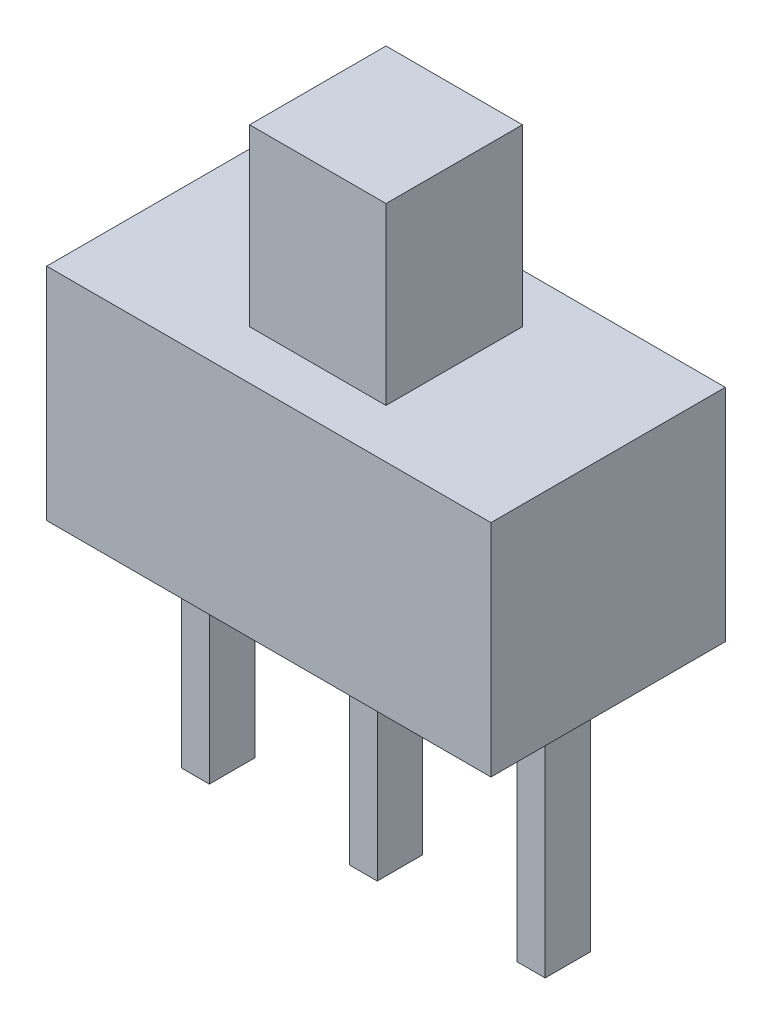
ISO-10303-21;
HEADER;
FILE_DESCRIPTION(('STEP AP214'),'2;1');
FILE_NAME('part.step','',(''),(''),'','','');
FILE_SCHEMA(('AUTOMOTIVE_DESIGN { 1 0 10303 214 1 1 1 1 }'));
ENDSEC;
DATA;
#1=APPLICATION_CONTEXT('core data for automotive mechanical design processes');
#2=APPLICATION_PROTOCOL_DEFINITION('international standard','automotive_design',2000,#1);
#3=PRODUCT_CONTEXT('',#1,'mechanical');
#4=PRODUCT('Part','Part','',(#3));
#5=PRODUCT_RELATED_PRODUCT_CATEGORY('part','',(#4));
#6=PRODUCT_DEFINITION_FORMATION('','',#4);
#7=PRODUCT_DEFINITION_CONTEXT('part definition',#1,'design');
#8=PRODUCT_DEFINITION('design','',#6,#7);
#9=PRODUCT_DEFINITION_SHAPE('','',#8);
#10=(LENGTH_UNIT() NAMED_UNIT(*) SI_UNIT(.MILLI.,.METRE.));
#11=(NAMED_UNIT(*) PLANE_ANGLE_UNIT() SI_UNIT($,.RADIAN.));
#12=(NAMED_UNIT(*) SI_UNIT($,.STERADIAN.) SOLID_ANGLE_UNIT());
#13=UNCERTAINTY_MEASURE_WITH_UNIT(LENGTH_MEASURE(1.E-05),#10,'distance_accuracy_value','');
#14=(GEOMETRIC_REPRESENTATION_CONTEXT(3) GLOBAL_UNCERTAINTY_ASSIGNED_CONTEXT((#13)) GLOBAL_UNIT_ASSIGNED_CONTEXT((#10,
#11,#12)) REPRESENTATION_CONTEXT('',''));
#15=CARTESIAN_POINT('',(0.,0.,0.));
#16=DIRECTION('',(0.,0.,1.));
#17=DIRECTION('',(1.,0.,0.));
#18=AXIS2_PLACEMENT_3D('',#15,#16,#17);
#19=CARTESIAN_POINT('',(0.,0.,0.));
#20=DIRECTION('',(0.,1.,0.));
#21=DIRECTION('',(0.,0.,1.));
#22=AXIS2_PLACEMENT_3D('',#19,#20,#21);
#23=PLANE('',#22);
#24=DIRECTION('',(0.,0.,1.));
#25=VECTOR('',#24,1.);
#26=CARTESIAN_POINT('',(-4.4,0.,-0.65));
#27=LINE('',#26,#25);
#28=CARTESIAN_POINT('',(-4.4,0.,-0.65));
#29=VERTEX_POINT('',#28);
#30=CARTESIAN_POINT('',(-4.4,0.,0.65));
#31=VERTEX_POINT('',#30);
#32=EDGE_CURVE('E195',#29,#31,#27,.T.);
#33=ORIENTED_EDGE('',*,*,#32,.F.);
#34=DIRECTION('',(1.,0.,0.));
#35=VECTOR('',#34,1.);
#36=CARTESIAN_POINT('',(-5.2,0.,-0.65));
#37=LINE('',#36,#35);
#38=CARTESIAN_POINT('',(-5.2,0.,-0.65));
#39=VERTEX_POINT('',#38);
#40=EDGE_CURVE('E208',#39,#29,#37,.T.);
#41=ORIENTED_EDGE('',*,*,#40,.F.);
#42=DIRECTION('',(0.,0.,-1.));
#43=VECTOR('',#42,1.);
#44=CARTESIAN_POINT('',(-5.2,0.,-0.65));
#45=LINE('',#44,#43);
#46=CARTESIAN_POINT('',(-5.2,0.,0.65));
#47=VERTEX_POINT('',#46);
#48=EDGE_CURVE('E217',#47,#39,#45,.T.);
#49=ORIENTED_EDGE('',*,*,#48,.F.);
#50=DIRECTION('',(-1.,0.,0.));
#51=VECTOR('',#50,1.);
#52=CARTESIAN_POINT('',(-5.2,0.,0.65));
#53=LINE('',#52,#51);
#54=EDGE_CURVE('E198',#31,#47,#53,.T.);
#55=ORIENTED_EDGE('',*,*,#54,.F.);
#56=EDGE_LOOP('',(#33,#41,#49,#55));
#57=FACE_BOUND('',#56,.T.);
#58=DIRECTION('',(0.,0.,-1.));
#59=VECTOR('',#58,1.);
#60=CARTESIAN_POINT('',(6.35,0.,-3.35));
#61=LINE('',#60,#59);
#62=CARTESIAN_POINT('',(6.35,0.,3.35));
#63=VERTEX_POINT('',#62);
#64=CARTESIAN_POINT('',(6.35,0.,-3.35));
#65=VERTEX_POINT('',#64);
#66=EDGE_CURVE('E299',#63,#65,#61,.T.);
#67=ORIENTED_EDGE('',*,*,#66,.F.);
#68=DIRECTION('',(1.,0.,0.));
#69=VECTOR('',#68,1.);
#70=CARTESIAN_POINT('',(-6.35,0.,3.35));
#71=LINE('',#70,#69);
#72=CARTESIAN_POINT('',(-6.35,0.,3.35));
#73=VERTEX_POINT('',#72);
#74=EDGE_CURVE('E304',#73,#63,#71,.T.);
#75=ORIENTED_EDGE('',*,*,#74,.F.);
#76=DIRECTION('',(0.,0.,1.));
#77=VECTOR('',#76,1.);
#78=CARTESIAN_POINT('',(-6.35,0.,-3.35));
#79=LINE('',#78,#77);
#80=CARTESIAN_POINT('',(-6.35,0.,-3.35));
#81=VERTEX_POINT('',#80);
#82=EDGE_CURVE('E315',#81,#73,#79,.T.);
#83=ORIENTED_EDGE('',*,*,#82,.F.);
#84=DIRECTION('',(-1.,0.,0.));
#85=VECTOR('',#84,1.);
#86=CARTESIAN_POINT('',(-6.35,0.,-3.35));
#87=LINE('',#86,#85);
#88=EDGE_CURVE('E313',#65,#81,#87,.T.);
#89=ORIENTED_EDGE('',*,*,#88,.F.);
#90=EDGE_LOOP('',(#67,#75,#83,#89));
#91=FACE_BOUND('',#90,.T.);
#92=DIRECTION('',(0.,0.,1.));
#93=VECTOR('',#92,1.);
#94=CARTESIAN_POINT('',(0.4,0.,-0.65));
#95=LINE('',#94,#93);
#96=CARTESIAN_POINT('',(0.4,0.,-0.65));
#97=VERTEX_POINT('',#96);
#98=CARTESIAN_POINT('',(0.4,0.,0.65));
#99=VERTEX_POINT('',#98);
#100=EDGE_CURVE('E233',#97,#99,#95,.T.);
#101=ORIENTED_EDGE('',*,*,#100,.F.);
#102=DIRECTION('',(1.,0.,0.));
#103=VECTOR('',#102,1.);
#104=CARTESIAN_POINT('',(-0.4,0.,-0.65));
#105=LINE('',#104,#103);
#106=CARTESIAN_POINT('',(-0.4,0.,-0.65));
#107=VERTEX_POINT('',#106);
#108=EDGE_CURVE('E238',#107,#97,#105,.T.);
#109=ORIENTED_EDGE('',*,*,#108,.F.);
#110=DIRECTION('',(0.,0.,-1.));
#111=VECTOR('',#110,1.);
#112=CARTESIAN_POINT('',(-0.4,0.,-0.65));
#113=LINE('',#112,#111);
#114=CARTESIAN_POINT('',(-0.4,0.,0.65));
#115=VERTEX_POINT('',#114);
#116=EDGE_CURVE('E250',#115,#107,#113,.T.);
#117=ORIENTED_EDGE('',*,*,#116,.F.);
#118=DIRECTION('',(-1.,0.,0.));
#119=VECTOR('',#118,1.);
#120=CARTESIAN_POINT('',(-0.4,0.,0.65));
#121=LINE('',#120,#119);
#122=EDGE_CURVE('E247',#99,#115,#121,.T.);
#123=ORIENTED_EDGE('',*,*,#122,.F.);
#124=EDGE_LOOP('',(#101,#109,#117,#123));
#125=FACE_BOUND('',#124,.T.);
#126=DIRECTION('',(0.,0.,1.));
#127=VECTOR('',#126,1.);
#128=CARTESIAN_POINT('',(5.2,0.,-0.65));
#129=LINE('',#128,#127);
#130=CARTESIAN_POINT('',(5.2,0.,-0.65));
#131=VERTEX_POINT('',#130);
#132=CARTESIAN_POINT('',(5.2,0.,0.65));
#133=VERTEX_POINT('',#132);
#134=EDGE_CURVE('E194',#131,#133,#129,.T.);
#135=ORIENTED_EDGE('',*,*,#134,.F.);
#136=DIRECTION('',(1.,0.,0.));
#137=VECTOR('',#136,1.);
#138=CARTESIAN_POINT('',(4.4,0.,-0.65));
#139=LINE('',#138,#137);
#140=CARTESIAN_POINT('',(4.4,0.,-0.65));
#141=VERTEX_POINT('',#140);
#142=EDGE_CURVE('E191',#141,#131,#139,.T.);
#143=ORIENTED_EDGE('',*,*,#142,.F.);
#144=DIRECTION('',(0.,0.,-1.));
#145=VECTOR('',#144,1.);
#146=CARTESIAN_POINT('',(4.4,0.,-0.65));
#147=LINE('',#146,#145);
#148=CARTESIAN_POINT('',(4.4,0.,0.65));
#149=VERTEX_POINT('',#148);
#150=EDGE_CURVE('E57',#149,#141,#147,.T.);
#151=ORIENTED_EDGE('',*,*,#150,.F.);
#152=DIRECTION('',(-1.,0.,0.));
#153=VECTOR('',#152,1.);
#154=CARTESIAN_POINT('',(4.4,0.,0.65));
#155=LINE('',#154,#153);
#156=EDGE_CURVE('E52',#133,#149,#155,.T.);
#157=ORIENTED_EDGE('',*,*,#156,.F.);
#158=EDGE_LOOP('',(#135,#143,#151,#157));
#159=FACE_BOUND('',#158,.T.);
#160=ADVANCED_FACE('F37',(#57,#91,#125,#159),#23,.F.);
#161=CARTESIAN_POINT('',(6.35,6.3,-3.35));
#162=DIRECTION('',(-1.,0.,0.));
#163=DIRECTION('',(0.,0.,1.));
#164=AXIS2_PLACEMENT_3D('',#161,#162,#163);
#165=PLANE('',#164);
#166=ORIENTED_EDGE('',*,*,#66,.T.);
#167=DIRECTION('',(0.,-1.,0.));
#168=VECTOR('',#167,1.);
#169=CARTESIAN_POINT('',(6.35,6.3,-3.35));
#170=LINE('',#169,#168);
#171=CARTESIAN_POINT('',(6.35,6.3,-3.35));
#172=VERTEX_POINT('',#171);
#173=EDGE_CURVE('E11',#172,#65,#170,.T.);
#174=ORIENTED_EDGE('',*,*,#173,.F.);
#175=DIRECTION('',(0.,0.,-1.));
#176=VECTOR('',#175,1.);
#177=CARTESIAN_POINT('',(6.35,6.3,-3.35));
#178=LINE('',#177,#176);
#179=CARTESIAN_POINT('',(6.35,6.3,3.35));
#180=VERTEX_POINT('',#179);
#181=EDGE_CURVE('E300',#180,#172,#178,.T.);
#182=ORIENTED_EDGE('',*,*,#181,.F.);
#183=DIRECTION('',(0.,-1.,0.));
#184=VECTOR('',#183,1.);
#185=CARTESIAN_POINT('',(6.35,6.3,3.35));
#186=LINE('',#185,#184);
#187=EDGE_CURVE('E310',#180,#63,#186,.T.);
#188=ORIENTED_EDGE('',*,*,#187,.T.);
#189=EDGE_LOOP('',(#166,#174,#182,#188));
#190=FACE_BOUND('',#189,.T.);
#191=ADVANCED_FACE('F39',(#190),#165,.F.);
#192=CARTESIAN_POINT('',(-6.35,6.3,-3.35));
#193=DIRECTION('',(0.,0.,1.));
#194=DIRECTION('',(1.,0.,0.));
#195=AXIS2_PLACEMENT_3D('',#192,#193,#194);
#196=PLANE('',#195);
#197=ORIENTED_EDGE('',*,*,#88,.T.);
#198=DIRECTION('',(0.,-1.,0.));
#199=VECTOR('',#198,1.);
#200=CARTESIAN_POINT('',(-6.35,6.3,-3.35));
#201=LINE('',#200,#199);
#202=CARTESIAN_POINT('',(-6.35,6.3,-3.35));
#203=VERTEX_POINT('',#202);
#204=EDGE_CURVE('E45',#203,#81,#201,.T.);
#205=ORIENTED_EDGE('',*,*,#204,.F.);
#206=DIRECTION('',(-1.,0.,0.));
#207=VECTOR('',#206,1.);
#208=CARTESIAN_POINT('',(-6.35,6.3,-3.35));
#209=LINE('',#208,#207);
#210=EDGE_CURVE('E303',#172,#203,#209,.T.);
#211=ORIENTED_EDGE('',*,*,#210,.F.);
#212=ORIENTED_EDGE('',*,*,#173,.T.);
#213=EDGE_LOOP('',(#197,#205,#211,#212));
#214=FACE_BOUND('',#213,.T.);
#215=ADVANCED_FACE('F343',(#214),#196,.F.);
#216=CARTESIAN_POINT('',(-6.35,6.3,-3.35));
#217=DIRECTION('',(1.,0.,0.));
#218=DIRECTION('',(0.,0.,-1.));
#219=AXIS2_PLACEMENT_3D('',#216,#217,#218);
#220=PLANE('',#219);
#221=ORIENTED_EDGE('',*,*,#82,.T.);
#222=DIRECTION('',(0.,-1.,0.));
#223=VECTOR('',#222,1.);
#224=CARTESIAN_POINT('',(-6.35,6.3,3.35));
#225=LINE('',#224,#223);
#226=CARTESIAN_POINT('',(-6.35,6.3,3.35));
#227=VERTEX_POINT('',#226);
#228=EDGE_CURVE('E320',#227,#73,#225,.T.);
#229=ORIENTED_EDGE('',*,*,#228,.F.);
#230=DIRECTION('',(0.,0.,1.));
#231=VECTOR('',#230,1.);
#232=CARTESIAN_POINT('',(-6.35,6.3,-3.35));
#233=LINE('',#232,#231);
#234=EDGE_CURVE('E306',#203,#227,#233,.T.);
#235=ORIENTED_EDGE('',*,*,#234,.F.);
#236=ORIENTED_EDGE('',*,*,#204,.T.);
#237=EDGE_LOOP('',(#221,#229,#235,#236));
#238=FACE_BOUND('',#237,.T.);
#239=ADVANCED_FACE('F327',(#238),#220,.F.);
#240=CARTESIAN_POINT('',(-6.35,6.3,3.35));
#241=DIRECTION('',(0.,0.,-1.));
#242=DIRECTION('',(-1.,0.,0.));
#243=AXIS2_PLACEMENT_3D('',#240,#241,#242);
#244=PLANE('',#243);
#245=ORIENTED_EDGE('',*,*,#74,.T.);
#246=ORIENTED_EDGE('',*,*,#187,.F.);
#247=DIRECTION('',(1.,0.,0.));
#248=VECTOR('',#247,1.);
#249=CARTESIAN_POINT('',(-6.35,6.3,3.35));
#250=LINE('',#249,#248);
#251=EDGE_CURVE('E308',#227,#180,#250,.T.);
#252=ORIENTED_EDGE('',*,*,#251,.F.);
#253=ORIENTED_EDGE('',*,*,#228,.T.);
#254=EDGE_LOOP('',(#245,#246,#252,#253));
#255=FACE_BOUND('',#254,.T.);
#256=ADVANCED_FACE('F336',(#255),#244,.F.);
#257=CARTESIAN_POINT('',(0.,6.3,0.));
#258=DIRECTION('',(0.,1.,0.));
#259=DIRECTION('',(0.,0.,1.));
#260=AXIS2_PLACEMENT_3D('',#257,#258,#259);
#261=PLANE('',#260);
#262=DIRECTION('',(0.,0.,-1.));
#263=VECTOR('',#262,1.);
#264=CARTESIAN_POINT('',(1.95,6.3,1.95));
#265=LINE('',#264,#263);
#266=CARTESIAN_POINT('',(1.95,6.3,1.95));
#267=VERTEX_POINT('',#266);
#268=CARTESIAN_POINT('',(1.95,6.3,-1.95));
#269=VERTEX_POINT('',#268);
#270=EDGE_CURVE('E266',#267,#269,#265,.T.);
#271=ORIENTED_EDGE('',*,*,#270,.F.);
#272=DIRECTION('',(1.,0.,0.));
#273=VECTOR('',#272,1.);
#274=CARTESIAN_POINT('',(-1.95,6.3,1.95));
#275=LINE('',#274,#273);
#276=CARTESIAN_POINT('',(-1.95,6.3,1.95));
#277=VERTEX_POINT('',#276);
#278=EDGE_CURVE('E271',#277,#267,#275,.T.);
#279=ORIENTED_EDGE('',*,*,#278,.F.);
#280=DIRECTION('',(0.,0.,1.));
#281=VECTOR('',#280,1.);
#282=CARTESIAN_POINT('',(-1.95,6.3,1.95));
#283=LINE('',#282,#281);
#284=CARTESIAN_POINT('',(-1.95,6.3,-1.95));
#285=VERTEX_POINT('',#284);
#286=EDGE_CURVE('E283',#285,#277,#283,.T.);
#287=ORIENTED_EDGE('',*,*,#286,.F.);
#288=DIRECTION('',(-1.,0.,0.));
#289=VECTOR('',#288,1.);
#290=CARTESIAN_POINT('',(-1.95,6.3,-1.95));
#291=LINE('',#290,#289);
#292=EDGE_CURVE('E280',#269,#285,#291,.T.);
#293=ORIENTED_EDGE('',*,*,#292,.F.);
#294=EDGE_LOOP('',(#271,#279,#287,#293));
#295=FACE_BOUND('',#294,.T.);
#296=ORIENTED_EDGE('',*,*,#181,.T.);
#297=ORIENTED_EDGE('',*,*,#210,.T.);
#298=ORIENTED_EDGE('',*,*,#234,.T.);
#299=ORIENTED_EDGE('',*,*,#251,.T.);
#300=EDGE_LOOP('',(#296,#297,#298,#299));
#301=FACE_BOUND('',#300,.T.);
#302=ADVANCED_FACE('F342',(#295,#301),#261,.T.);
#303=CARTESIAN_POINT('',(1.95,11.3,1.95));
#304=DIRECTION('',(-1.,0.,0.));
#305=DIRECTION('',(0.,0.,1.));
#306=AXIS2_PLACEMENT_3D('',#303,#304,#305);
#307=PLANE('',#306);
#308=ORIENTED_EDGE('',*,*,#270,.T.);
#309=DIRECTION('',(0.,-1.,0.));
#310=VECTOR('',#309,1.);
#311=CARTESIAN_POINT('',(1.95,11.3,-1.95));
#312=LINE('',#311,#310);
#313=CARTESIAN_POINT('',(1.95,11.3,-1.95));
#314=VERTEX_POINT('',#313);
#315=EDGE_CURVE('E296',#314,#269,#312,.T.);
#316=ORIENTED_EDGE('',*,*,#315,.F.);
#317=DIRECTION('',(0.,0.,-1.));
#318=VECTOR('',#317,1.);
#319=CARTESIAN_POINT('',(1.95,11.3,1.95));
#320=LINE('',#319,#318);
#321=CARTESIAN_POINT('',(1.95,11.3,1.95));
#322=VERTEX_POINT('',#321);
#323=EDGE_CURVE('E267',#322,#314,#320,.T.);
#324=ORIENTED_EDGE('',*,*,#323,.F.);
#325=DIRECTION('',(0.,-1.,0.));
#326=VECTOR('',#325,1.);
#327=CARTESIAN_POINT('',(1.95,11.3,1.95));
#328=LINE('',#327,#326);
#329=EDGE_CURVE('E277',#322,#267,#328,.T.);
#330=ORIENTED_EDGE('',*,*,#329,.T.);
#331=EDGE_LOOP('',(#308,#316,#324,#330));
#332=FACE_BOUND('',#331,.T.);
#333=ADVANCED_FACE('F362',(#332),#307,.F.);
#334=CARTESIAN_POINT('',(-1.95,11.3,-1.95));
#335=DIRECTION('',(0.,0.,1.));
#336=DIRECTION('',(1.,0.,0.));
#337=AXIS2_PLACEMENT_3D('',#334,#335,#336);
#338=PLANE('',#337);
#339=ORIENTED_EDGE('',*,*,#292,.T.);
#340=DIRECTION('',(0.,-1.,0.));
#341=VECTOR('',#340,1.);
#342=CARTESIAN_POINT('',(-1.95,11.3,-1.95));
#343=LINE('',#342,#341);
#344=CARTESIAN_POINT('',(-1.95,11.3,-1.95));
#345=VERTEX_POINT('',#344);
#346=EDGE_CURVE('E293',#345,#285,#343,.T.);
#347=ORIENTED_EDGE('',*,*,#346,.F.);
#348=DIRECTION('',(-1.,0.,0.));
#349=VECTOR('',#348,1.);
#350=CARTESIAN_POINT('',(-1.95,11.3,-1.95));
#351=LINE('',#350,#349);
#352=EDGE_CURVE('E270',#314,#345,#351,.T.);
#353=ORIENTED_EDGE('',*,*,#352,.F.);
#354=ORIENTED_EDGE('',*,*,#315,.T.);
#355=EDGE_LOOP('',(#339,#347,#353,#354));
#356=FACE_BOUND('',#355,.T.);
#357=ADVANCED_FACE('F367',(#356),#338,.F.);
#358=CARTESIAN_POINT('',(-1.95,11.3,1.95));
#359=DIRECTION('',(1.,0.,0.));
#360=DIRECTION('',(0.,0.,-1.));
#361=AXIS2_PLACEMENT_3D('',#358,#359,#360);
#362=PLANE('',#361);
#363=ORIENTED_EDGE('',*,*,#286,.T.);
#364=DIRECTION('',(0.,-1.,0.));
#365=VECTOR('',#364,1.);
#366=CARTESIAN_POINT('',(-1.95,11.3,1.95));
#367=LINE('',#366,#365);
#368=CARTESIAN_POINT('',(-1.95,11.3,1.95));
#369=VERTEX_POINT('',#368);
#370=EDGE_CURVE('E290',#369,#277,#367,.T.);
#371=ORIENTED_EDGE('',*,*,#370,.F.);
#372=DIRECTION('',(0.,0.,1.));
#373=VECTOR('',#372,1.);
#374=CARTESIAN_POINT('',(-1.95,11.3,1.95));
#375=LINE('',#374,#373);
#376=EDGE_CURVE('E273',#345,#369,#375,.T.);
#377=ORIENTED_EDGE('',*,*,#376,.F.);
#378=ORIENTED_EDGE('',*,*,#346,.T.);
#379=EDGE_LOOP('',(#363,#371,#377,#378));
#380=FACE_BOUND('',#379,.T.);
#381=ADVANCED_FACE('F381',(#380),#362,.F.);
#382=CARTESIAN_POINT('',(-1.95,11.3,1.95));
#383=DIRECTION('',(0.,0.,-1.));
#384=DIRECTION('',(-1.,0.,0.));
#385=AXIS2_PLACEMENT_3D('',#382,#383,#384);
#386=PLANE('',#385);
#387=ORIENTED_EDGE('',*,*,#278,.T.);
#388=ORIENTED_EDGE('',*,*,#329,.F.);
#389=DIRECTION('',(1.,0.,0.));
#390=VECTOR('',#389,1.);
#391=CARTESIAN_POINT('',(-1.95,11.3,1.95));
#392=LINE('',#391,#390);
#393=EDGE_CURVE('E275',#369,#322,#392,.T.);
#394=ORIENTED_EDGE('',*,*,#393,.F.);
#395=ORIENTED_EDGE('',*,*,#370,.T.);
#396=EDGE_LOOP('',(#387,#388,#394,#395));
#397=FACE_BOUND('',#396,.T.);
#398=ADVANCED_FACE('F372',(#397),#386,.F.);
#399=CARTESIAN_POINT('',(0.,11.3,0.));
#400=DIRECTION('',(0.,-1.,0.));
#401=DIRECTION('',(0.,0.,-1.));
#402=AXIS2_PLACEMENT_3D('',#399,#400,#401);
#403=PLANE('',#402);
#404=ORIENTED_EDGE('',*,*,#323,.T.);
#405=ORIENTED_EDGE('',*,*,#352,.T.);
#406=ORIENTED_EDGE('',*,*,#376,.T.);
#407=ORIENTED_EDGE('',*,*,#393,.T.);
#408=EDGE_LOOP('',(#404,#405,#406,#407));
#409=FACE_BOUND('',#408,.T.);
#410=ADVANCED_FACE('F377',(#409),#403,.F.);
#411=CARTESIAN_POINT('',(0.4,-6.9,-0.65));
#412=DIRECTION('',(-1.,0.,0.));
#413=DIRECTION('',(0.,0.,1.));
#414=AXIS2_PLACEMENT_3D('',#411,#412,#413);
#415=PLANE('',#414);
#416=ORIENTED_EDGE('',*,*,#100,.T.);
#417=DIRECTION('',(0.,1.,0.));
#418=VECTOR('',#417,1.);
#419=CARTESIAN_POINT('',(0.4,-6.9,0.65));
#420=LINE('',#419,#418);
#421=CARTESIAN_POINT('',(0.4,-6.9,0.65));
#422=VERTEX_POINT('',#421);
#423=EDGE_CURVE('E263',#422,#99,#420,.T.);
#424=ORIENTED_EDGE('',*,*,#423,.F.);
#425=DIRECTION('',(0.,0.,1.));
#426=VECTOR('',#425,1.);
#427=CARTESIAN_POINT('',(0.4,-6.9,-0.65));
#428=LINE('',#427,#426);
#429=CARTESIAN_POINT('',(0.4,-6.9,-0.65));
#430=VERTEX_POINT('',#429);
#431=EDGE_CURVE('E234',#430,#422,#428,.T.);
#432=ORIENTED_EDGE('',*,*,#431,.F.);
#433=DIRECTION('',(0.,1.,0.));
#434=VECTOR('',#433,1.);
#435=CARTESIAN_POINT('',(0.4,-6.9,-0.65));
#436=LINE('',#435,#434);
#437=EDGE_CURVE('E244',#430,#97,#436,.T.);
#438=ORIENTED_EDGE('',*,*,#437,.T.);
#439=EDGE_LOOP('',(#416,#424,#432,#438));
#440=FACE_BOUND('',#439,.T.);
#441=ADVANCED_FACE('F394',(#440),#415,.F.);
#442=CARTESIAN_POINT('',(-0.4,-6.9,0.65));
#443=DIRECTION('',(0.,0.,-1.));
#444=DIRECTION('',(-1.,0.,0.));
#445=AXIS2_PLACEMENT_3D('',#442,#443,#444);
#446=PLANE('',#445);
#447=ORIENTED_EDGE('',*,*,#122,.T.);
#448=DIRECTION('',(0.,1.,0.));
#449=VECTOR('',#448,1.);
#450=CARTESIAN_POINT('',(-0.4,-6.9,0.65));
#451=LINE('',#450,#449);
#452=CARTESIAN_POINT('',(-0.4,-6.9,0.65));
#453=VERTEX_POINT('',#452);
#454=EDGE_CURVE('E260',#453,#115,#451,.T.);
#455=ORIENTED_EDGE('',*,*,#454,.F.);
#456=DIRECTION('',(-1.,0.,0.));
#457=VECTOR('',#456,1.);
#458=CARTESIAN_POINT('',(-0.4,-6.9,0.65));
#459=LINE('',#458,#457);
#460=EDGE_CURVE('E237',#422,#453,#459,.T.);
#461=ORIENTED_EDGE('',*,*,#460,.F.);
#462=ORIENTED_EDGE('',*,*,#423,.T.);
#463=EDGE_LOOP('',(#447,#455,#461,#462));
#464=FACE_BOUND('',#463,.T.);
#465=ADVANCED_FACE('F397',(#464),#446,.F.);
#466=CARTESIAN_POINT('',(-0.4,-6.9,-0.65));
#467=DIRECTION('',(1.,0.,0.));
#468=DIRECTION('',(0.,0.,-1.));
#469=AXIS2_PLACEMENT_3D('',#466,#467,#468);
#470=PLANE('',#469);
#471=ORIENTED_EDGE('',*,*,#116,.T.);
#472=DIRECTION('',(0.,1.,0.));
#473=VECTOR('',#472,1.);
#474=CARTESIAN_POINT('',(-0.4,-6.9,-0.65));
#475=LINE('',#474,#473);
#476=CARTESIAN_POINT('',(-0.4,-6.9,-0.65));
#477=VERTEX_POINT('',#476);
#478=EDGE_CURVE('E257',#477,#107,#475,.T.);
#479=ORIENTED_EDGE('',*,*,#478,.F.);
#480=DIRECTION('',(0.,0.,-1.));
#481=VECTOR('',#480,1.);
#482=CARTESIAN_POINT('',(-0.4,-6.9,-0.65));
#483=LINE('',#482,#481);
#484=EDGE_CURVE('E240',#453,#477,#483,.T.);
#485=ORIENTED_EDGE('',*,*,#484,.F.);
#486=ORIENTED_EDGE('',*,*,#454,.T.);
#487=EDGE_LOOP('',(#471,#479,#485,#486));
#488=FACE_BOUND('',#487,.T.);
#489=ADVANCED_FACE('F401',(#488),#470,.F.);
#490=CARTESIAN_POINT('',(-0.4,-6.9,-0.65));
#491=DIRECTION('',(0.,0.,1.));
#492=DIRECTION('',(1.,0.,0.));
#493=AXIS2_PLACEMENT_3D('',#490,#491,#492);
#494=PLANE('',#493);
#495=ORIENTED_EDGE('',*,*,#108,.T.);
#496=ORIENTED_EDGE('',*,*,#437,.F.);
#497=DIRECTION('',(1.,0.,0.));
#498=VECTOR('',#497,1.);
#499=CARTESIAN_POINT('',(-0.4,-6.9,-0.65));
#500=LINE('',#499,#498);
#501=EDGE_CURVE('E242',#477,#430,#500,.T.);
#502=ORIENTED_EDGE('',*,*,#501,.F.);
#503=ORIENTED_EDGE('',*,*,#478,.T.);
#504=EDGE_LOOP('',(#495,#496,#502,#503));
#505=FACE_BOUND('',#504,.T.);
#506=ADVANCED_FACE('F405',(#505),#494,.F.);
#507=CARTESIAN_POINT('',(0.,-6.9,0.));
#508=DIRECTION('',(0.,1.,0.));
#509=DIRECTION('',(0.,0.,1.));
#510=AXIS2_PLACEMENT_3D('',#507,#508,#509);
#511=PLANE('',#510);
#512=ORIENTED_EDGE('',*,*,#431,.T.);
#513=ORIENTED_EDGE('',*,*,#460,.T.);
#514=ORIENTED_EDGE('',*,*,#484,.T.);
#515=ORIENTED_EDGE('',*,*,#501,.T.);
#516=EDGE_LOOP('',(#512,#513,#514,#515));
#517=FACE_BOUND('',#516,.T.);
#518=ADVANCED_FACE('F409',(#517),#511,.F.);
#519=CARTESIAN_POINT('',(-4.4,-6.9,-0.65));
#520=DIRECTION('',(-1.,0.,0.));
#521=DIRECTION('',(0.,0.,1.));
#522=AXIS2_PLACEMENT_3D('',#519,#520,#521);
#523=PLANE('',#522);
#524=ORIENTED_EDGE('',*,*,#32,.T.);
#525=DIRECTION('',(0.,1.,0.));
#526=VECTOR('',#525,1.);
#527=CARTESIAN_POINT('',(-4.4,-6.9,0.65));
#528=LINE('',#527,#526);
#529=CARTESIAN_POINT('',(-4.4,-6.9,0.65));
#530=VERTEX_POINT('',#529);
#531=EDGE_CURVE('E230',#530,#31,#528,.T.);
#532=ORIENTED_EDGE('',*,*,#531,.F.);
#533=DIRECTION('',(0.,0.,1.));
#534=VECTOR('',#533,1.);
#535=CARTESIAN_POINT('',(-4.4,-6.9,-0.65));
#536=LINE('',#535,#534);
#537=CARTESIAN_POINT('',(-4.4,-6.9,-0.65));
#538=VERTEX_POINT('',#537);
#539=EDGE_CURVE('E204',#538,#530,#536,.T.);
#540=ORIENTED_EDGE('',*,*,#539,.F.);
#541=DIRECTION('',(0.,1.,0.));
#542=VECTOR('',#541,1.);
#543=CARTESIAN_POINT('',(-4.4,-6.9,-0.65));
#544=LINE('',#543,#542);
#545=EDGE_CURVE('E213',#538,#29,#544,.T.);
#546=ORIENTED_EDGE('',*,*,#545,.T.);
#547=EDGE_LOOP('',(#524,#532,#540,#546));
#548=FACE_BOUND('',#547,.T.);
#549=ADVANCED_FACE('F413',(#548),#523,.F.);
#550=CARTESIAN_POINT('',(-5.2,-6.9,0.65));
#551=DIRECTION('',(0.,0.,-1.));
#552=DIRECTION('',(-1.,0.,0.));
#553=AXIS2_PLACEMENT_3D('',#550,#551,#552);
#554=PLANE('',#553);
#555=ORIENTED_EDGE('',*,*,#54,.T.);
#556=DIRECTION('',(0.,1.,0.));
#557=VECTOR('',#556,1.);
#558=CARTESIAN_POINT('',(-5.2,-6.9,0.65));
#559=LINE('',#558,#557);
#560=CARTESIAN_POINT('',(-5.2,-6.9,0.65));
#561=VERTEX_POINT('',#560);
#562=EDGE_CURVE('E227',#561,#47,#559,.T.);
#563=ORIENTED_EDGE('',*,*,#562,.F.);
#564=DIRECTION('',(-1.,0.,0.));
#565=VECTOR('',#564,1.);
#566=CARTESIAN_POINT('',(-5.2,-6.9,0.65));
#567=LINE('',#566,#565);
#568=EDGE_CURVE('E207',#530,#561,#567,.T.);
#569=ORIENTED_EDGE('',*,*,#568,.F.);
#570=ORIENTED_EDGE('',*,*,#531,.T.);
#571=EDGE_LOOP('',(#555,#563,#569,#570));
#572=FACE_BOUND('',#571,.T.);
#573=ADVANCED_FACE('F417',(#572),#554,.F.);
#574=CARTESIAN_POINT('',(-5.2,-6.9,-0.65));
#575=DIRECTION('',(1.,0.,0.));
#576=DIRECTION('',(0.,0.,-1.));
#577=AXIS2_PLACEMENT_3D('',#574,#575,#576);
#578=PLANE('',#577);
#579=ORIENTED_EDGE('',*,*,#48,.T.);
#580=DIRECTION('',(0.,1.,0.));
#581=VECTOR('',#580,1.);
#582=CARTESIAN_POINT('',(-5.2,-6.9,-0.65));
#583=LINE('',#582,#581);
#584=CARTESIAN_POINT('',(-5.2,-6.9,-0.65));
#585=VERTEX_POINT('',#584);
#586=EDGE_CURVE('E224',#585,#39,#583,.T.);
#587=ORIENTED_EDGE('',*,*,#586,.F.);
#588=DIRECTION('',(0.,0.,-1.));
#589=VECTOR('',#588,1.);
#590=CARTESIAN_POINT('',(-5.2,-6.9,-0.65));
#591=LINE('',#590,#589);
#592=EDGE_CURVE('E210',#561,#585,#591,.T.);
#593=ORIENTED_EDGE('',*,*,#592,.F.);
#594=ORIENTED_EDGE('',*,*,#562,.T.);
#595=EDGE_LOOP('',(#579,#587,#593,#594));
#596=FACE_BOUND('',#595,.T.);
#597=ADVANCED_FACE('F421',(#596),#578,.F.);
#598=CARTESIAN_POINT('',(-5.2,-6.9,-0.65));
#599=DIRECTION('',(0.,0.,1.));
#600=DIRECTION('',(1.,0.,0.));
#601=AXIS2_PLACEMENT_3D('',#598,#599,#600);
#602=PLANE('',#601);
#603=ORIENTED_EDGE('',*,*,#40,.T.);
#604=ORIENTED_EDGE('',*,*,#545,.F.);
#605=DIRECTION('',(1.,0.,0.));
#606=VECTOR('',#605,1.);
#607=CARTESIAN_POINT('',(-5.2,-6.9,-0.65));
#608=LINE('',#607,#606);
#609=EDGE_CURVE('E212',#585,#538,#608,.T.);
#610=ORIENTED_EDGE('',*,*,#609,.F.);
#611=ORIENTED_EDGE('',*,*,#586,.T.);
#612=EDGE_LOOP('',(#603,#604,#610,#611));
#613=FACE_BOUND('',#612,.T.);
#614=ADVANCED_FACE('F425',(#613),#602,.F.);
#615=CARTESIAN_POINT('',(0.,-6.9,0.));
#616=DIRECTION('',(0.,1.,0.));
#617=DIRECTION('',(0.,0.,1.));
#618=AXIS2_PLACEMENT_3D('',#615,#616,#617);
#619=PLANE('',#618);
#620=ORIENTED_EDGE('',*,*,#539,.T.);
#621=ORIENTED_EDGE('',*,*,#568,.T.);
#622=ORIENTED_EDGE('',*,*,#592,.T.);
#623=ORIENTED_EDGE('',*,*,#609,.T.);
#624=EDGE_LOOP('',(#620,#621,#622,#623));
#625=FACE_BOUND('',#624,.T.);
#626=ADVANCED_FACE('F429',(#625),#619,.F.);
#627=CARTESIAN_POINT('',(5.2,-6.9,-0.65));
#628=DIRECTION('',(-1.,0.,0.));
#629=DIRECTION('',(0.,0.,1.));
#630=AXIS2_PLACEMENT_3D('',#627,#628,#629);
#631=PLANE('',#630);
#632=ORIENTED_EDGE('',*,*,#134,.T.);
#633=DIRECTION('',(0.,1.,0.));
#634=VECTOR('',#633,1.);
#635=CARTESIAN_POINT('',(5.2,-6.9,0.65));
#636=LINE('',#635,#634);
#637=CARTESIAN_POINT('',(5.2,-6.9,0.65));
#638=VERTEX_POINT('',#637);
#639=EDGE_CURVE('E175',#638,#133,#636,.T.);
#640=ORIENTED_EDGE('',*,*,#639,.F.);
#641=DIRECTION('',(0.,0.,1.));
#642=VECTOR('',#641,1.);
#643=CARTESIAN_POINT('',(5.2,-6.9,-0.65));
#644=LINE('',#643,#642);
#645=CARTESIAN_POINT('',(5.2,-6.9,-0.65));
#646=VERTEX_POINT('',#645);
#647=EDGE_CURVE('E182',#646,#638,#644,.T.);
#648=ORIENTED_EDGE('',*,*,#647,.F.);
#649=DIRECTION('',(0.,1.,0.));
#650=VECTOR('',#649,1.);
#651=CARTESIAN_POINT('',(5.2,-6.9,-0.65));
#652=LINE('',#651,#650);
#653=EDGE_CURVE('E643',#646,#131,#652,.T.);
#654=ORIENTED_EDGE('',*,*,#653,.T.);
#655=EDGE_LOOP('',(#632,#640,#648,#654));
#656=FACE_BOUND('',#655,.T.);
#657=ADVANCED_FACE('F193',(#656),#631,.F.);
#658=CARTESIAN_POINT('',(4.4,-6.9,0.65));
#659=DIRECTION('',(0.,0.,-1.));
#660=DIRECTION('',(-1.,0.,0.));
#661=AXIS2_PLACEMENT_3D('',#658,#659,#660);
#662=PLANE('',#661);
#663=ORIENTED_EDGE('',*,*,#156,.T.);
#664=DIRECTION('',(0.,1.,0.));
#665=VECTOR('',#664,1.);
#666=CARTESIAN_POINT('',(4.4,-6.9,0.65));
#667=LINE('',#666,#665);
#668=CARTESIAN_POINT('',(4.4,-6.9,0.65));
#669=VERTEX_POINT('',#668);
#670=EDGE_CURVE('E178',#669,#149,#667,.T.);
#671=ORIENTED_EDGE('',*,*,#670,.F.);
#672=DIRECTION('',(-1.,0.,0.));
#673=VECTOR('',#672,1.);
#674=CARTESIAN_POINT('',(4.4,-6.9,0.65));
#675=LINE('',#674,#673);
#676=EDGE_CURVE('E171',#638,#669,#675,.T.);
#677=ORIENTED_EDGE('',*,*,#676,.F.);
#678=ORIENTED_EDGE('',*,*,#639,.T.);
#679=EDGE_LOOP('',(#663,#671,#677,#678));
#680=FACE_BOUND('',#679,.T.);
#681=ADVANCED_FACE('F173',(#680),#662,.F.);
#682=CARTESIAN_POINT('',(4.4,-6.9,-0.65));
#683=DIRECTION('',(1.,0.,0.));
#684=DIRECTION('',(0.,0.,-1.));
#685=AXIS2_PLACEMENT_3D('',#682,#683,#684);
#686=PLANE('',#685);
#687=ORIENTED_EDGE('',*,*,#150,.T.);
#688=DIRECTION('',(0.,1.,0.));
#689=VECTOR('',#688,1.);
#690=CARTESIAN_POINT('',(4.4,-6.9,-0.65));
#691=LINE('',#690,#689);
#692=CARTESIAN_POINT('',(4.4,-6.9,-0.65));
#693=VERTEX_POINT('',#692);
#694=EDGE_CURVE('E200',#693,#141,#691,.T.);
#695=ORIENTED_EDGE('',*,*,#694,.F.);
#696=DIRECTION('',(0.,0.,-1.));
#697=VECTOR('',#696,1.);
#698=CARTESIAN_POINT('',(4.4,-6.9,-0.65));
#699=LINE('',#698,#697);
#700=EDGE_CURVE('E181',#669,#693,#699,.T.);
#701=ORIENTED_EDGE('',*,*,#700,.F.);
#702=ORIENTED_EDGE('',*,*,#670,.T.);
#703=EDGE_LOOP('',(#687,#695,#701,#702));
#704=FACE_BOUND('',#703,.T.);
#705=ADVANCED_FACE('F438',(#704),#686,.F.);
#706=CARTESIAN_POINT('',(4.4,-6.9,-0.65));
#707=DIRECTION('',(0.,0.,1.));
#708=DIRECTION('',(1.,0.,0.));
#709=AXIS2_PLACEMENT_3D('',#706,#707,#708);
#710=PLANE('',#709);
#711=ORIENTED_EDGE('',*,*,#142,.T.);
#712=ORIENTED_EDGE('',*,*,#653,.F.);
#713=DIRECTION('',(1.,0.,0.));
#714=VECTOR('',#713,1.);
#715=CARTESIAN_POINT('',(4.4,-6.9,-0.65));
#716=LINE('',#715,#714);
#717=EDGE_CURVE('E187',#693,#646,#716,.T.);
#718=ORIENTED_EDGE('',*,*,#717,.F.);
#719=ORIENTED_EDGE('',*,*,#694,.T.);
#720=EDGE_LOOP('',(#711,#712,#718,#719));
#721=FACE_BOUND('',#720,.T.);
#722=ADVANCED_FACE('F441',(#721),#710,.F.);
#723=CARTESIAN_POINT('',(0.,-6.9,0.));
#724=DIRECTION('',(0.,1.,0.));
#725=DIRECTION('',(0.,0.,1.));
#726=AXIS2_PLACEMENT_3D('',#723,#724,#725);
#727=PLANE('',#726);
#728=ORIENTED_EDGE('',*,*,#647,.T.);
#729=ORIENTED_EDGE('',*,*,#676,.T.);
#730=ORIENTED_EDGE('',*,*,#700,.T.);
#731=ORIENTED_EDGE('',*,*,#717,.T.);
#732=EDGE_LOOP('',(#728,#729,#730,#731));
#733=FACE_BOUND('',#732,.T.);
#734=ADVANCED_FACE('F185',(#733),#727,.F.);
#735=CLOSED_SHELL('',(#160,#191,#215,#239,#256,#302,#333,#357,#381,#398,#410,#441,#465,#489,
#506,#518,#549,#573,#597,#614,#626,#657,#681,#705,#722,#734));
#736=MANIFOLD_SOLID_BREP('B2',#735);
#737=ADVANCED_BREP_SHAPE_REPRESENTATION('',(#18,#736),#14);
#738=SHAPE_DEFINITION_REPRESENTATION(#9,#737);
ENDSEC;
END-ISO-10303-21;
